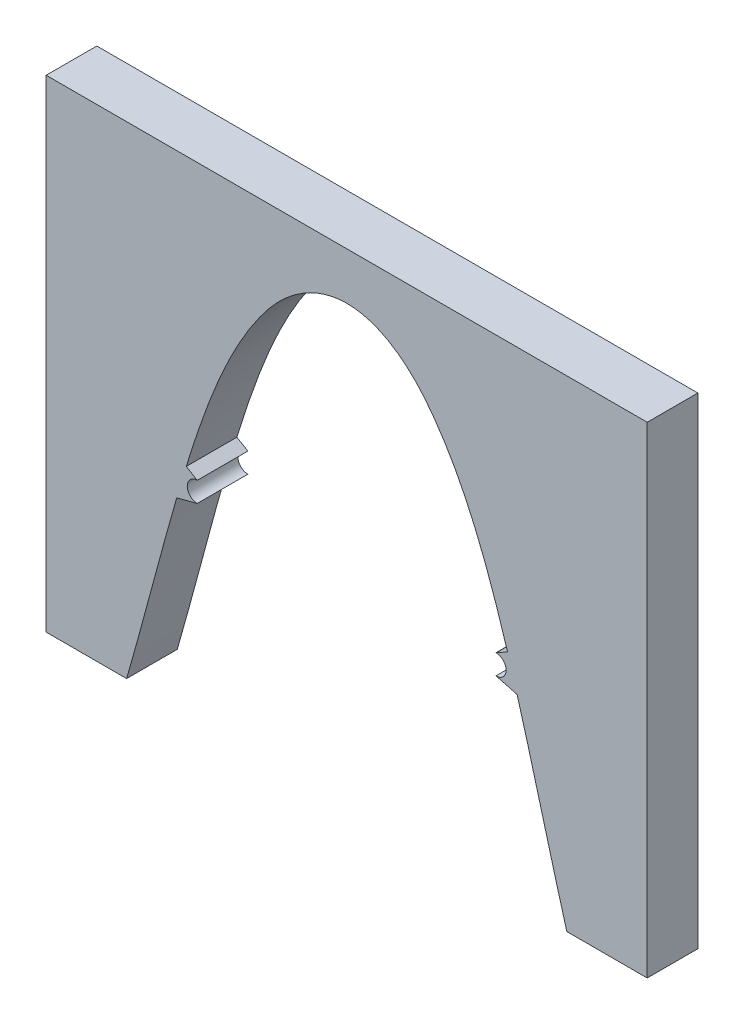
ISO-10303-21;
HEADER;
FILE_DESCRIPTION(('STEP AP214'),'2;1');
FILE_NAME('part.step','',(''),(''),'','','');
FILE_SCHEMA(('AUTOMOTIVE_DESIGN { 1 0 10303 214 1 1 1 1 }'));
ENDSEC;
DATA;
#1=APPLICATION_CONTEXT('core data for automotive mechanical design processes');
#2=APPLICATION_PROTOCOL_DEFINITION('international standard','automotive_design',2000,#1);
#3=PRODUCT_CONTEXT('',#1,'mechanical');
#4=PRODUCT('Part','Part','',(#3));
#5=PRODUCT_RELATED_PRODUCT_CATEGORY('part','',(#4));
#6=PRODUCT_DEFINITION_FORMATION('','',#4);
#7=PRODUCT_DEFINITION_CONTEXT('part definition',#1,'design');
#8=PRODUCT_DEFINITION('design','',#6,#7);
#9=PRODUCT_DEFINITION_SHAPE('','',#8);
#10=(LENGTH_UNIT() NAMED_UNIT(*) SI_UNIT(.MILLI.,.METRE.));
#11=(NAMED_UNIT(*) PLANE_ANGLE_UNIT() SI_UNIT($,.RADIAN.));
#12=(NAMED_UNIT(*) SI_UNIT($,.STERADIAN.) SOLID_ANGLE_UNIT());
#13=UNCERTAINTY_MEASURE_WITH_UNIT(LENGTH_MEASURE(1.E-05),#10,'distance_accuracy_value','');
#14=(GEOMETRIC_REPRESENTATION_CONTEXT(3) GLOBAL_UNCERTAINTY_ASSIGNED_CONTEXT((#13)) GLOBAL_UNIT_ASSIGNED_CONTEXT((#10,
#11,#12)) REPRESENTATION_CONTEXT('',''));
#15=CARTESIAN_POINT('',(0.,0.,0.));
#16=DIRECTION('',(0.,0.,1.));
#17=DIRECTION('',(1.,0.,0.));
#18=AXIS2_PLACEMENT_3D('',#15,#16,#17);
#19=CARTESIAN_POINT('',(124.901892582603,-12.896168333949,48.006));
#20=DIRECTION('',(0.,0.,-1.));
#21=DIRECTION('',(-1.,0.,0.));
#22=AXIS2_PLACEMENT_3D('',#19,#20,#21);
#23=CYLINDRICAL_SURFACE('',#22,9.49896947600651);
#24=CARTESIAN_POINT('',(124.901892582603,-12.896168333949,0.));
#25=DIRECTION('',(0.,0.,-1.));
#26=DIRECTION('',(1.,0.,0.));
#27=AXIS2_PLACEMENT_3D('',#24,#25,#26);
#28=CIRCLE('',#27,9.49896947600651);
#29=CARTESIAN_POINT('',(124.736169769664,-3.39864460113484,0.));
#30=VERTEX_POINT('',#29);
#31=CARTESIAN_POINT('',(124.736169769664,-22.3936920667635,0.));
#32=VERTEX_POINT('',#31);
#33=EDGE_CURVE('E367',#30,#32,#28,.T.);
#34=ORIENTED_EDGE('',*,*,#33,.T.);
#35=DIRECTION('',(0.,0.,-1.));
#36=VECTOR('',#35,1.);
#37=CARTESIAN_POINT('',(124.736169769664,-22.3936920667635,48.006));
#38=LINE('',#37,#36);
#39=CARTESIAN_POINT('',(124.736169769664,-22.3936920667635,48.006));
#40=VERTEX_POINT('',#39);
#41=EDGE_CURVE('E12',#40,#32,#38,.T.);
#42=ORIENTED_EDGE('',*,*,#41,.F.);
#43=CARTESIAN_POINT('',(124.901892582603,-12.896168333949,48.006));
#44=DIRECTION('',(0.,0.,-1.));
#45=DIRECTION('',(1.,0.,0.));
#46=AXIS2_PLACEMENT_3D('',#43,#44,#45);
#47=CIRCLE('',#46,9.49896947600651);
#48=CARTESIAN_POINT('',(124.736169769664,-3.39864460113484,48.006));
#49=VERTEX_POINT('',#48);
#50=EDGE_CURVE('E337',#49,#40,#47,.T.);
#51=ORIENTED_EDGE('',*,*,#50,.F.);
#52=DIRECTION('',(0.,0.,-1.));
#53=VECTOR('',#52,1.);
#54=CARTESIAN_POINT('',(124.736169769664,-3.39864460113484,48.006));
#55=LINE('',#54,#53);
#56=EDGE_CURVE('E190',#49,#30,#55,.T.);
#57=ORIENTED_EDGE('',*,*,#56,.T.);
#58=EDGE_LOOP('',(#34,#42,#51,#57));
#59=FACE_BOUND('',#58,.T.);
#60=ADVANCED_FACE('F40',(#59),#23,.F.);
#61=CARTESIAN_POINT('',(124.99306620108,-12.8961683339493,48.006));
#62=DIRECTION('',(0.,0.,-1.));
#63=DIRECTION('',(-1.,0.,0.));
#64=AXIS2_PLACEMENT_3D('',#61,#62,#63);
#65=CYLINDRICAL_SURFACE('',#64,9.50099746510036);
#66=CARTESIAN_POINT('',(124.99306620108,-12.8961683339493,0.));
#67=DIRECTION('',(0.,0.,1.));
#68=DIRECTION('',(-1.,0.,0.));
#69=AXIS2_PLACEMENT_3D('',#66,#67,#68);
#70=CIRCLE('',#69,9.50099746510036);
#71=CARTESIAN_POINT('',(124.993066201054,-22.3971657990497,0.));
#72=VERTEX_POINT('',#71);
#73=EDGE_CURVE('E364',#32,#72,#70,.T.);
#74=ORIENTED_EDGE('',*,*,#73,.T.);
#75=DIRECTION('',(0.,0.,-1.));
#76=VECTOR('',#75,1.);
#77=CARTESIAN_POINT('',(124.993066201054,-22.3971657990497,48.006));
#78=LINE('',#77,#76);
#79=CARTESIAN_POINT('',(124.993066201054,-22.3971657990497,48.006));
#80=VERTEX_POINT('',#79);
#81=EDGE_CURVE('E50',#80,#72,#78,.T.);
#82=ORIENTED_EDGE('',*,*,#81,.F.);
#83=CARTESIAN_POINT('',(124.99306620108,-12.8961683339493,48.006));
#84=DIRECTION('',(0.,0.,1.));
#85=DIRECTION('',(-1.,0.,0.));
#86=AXIS2_PLACEMENT_3D('',#83,#84,#85);
#87=CIRCLE('',#86,9.50099746510036);
#88=EDGE_CURVE('E126',#40,#80,#87,.T.);
#89=ORIENTED_EDGE('',*,*,#88,.F.);
#90=ORIENTED_EDGE('',*,*,#41,.T.);
#91=EDGE_LOOP('',(#74,#82,#89,#90));
#92=FACE_BOUND('',#91,.T.);
#93=ADVANCED_FACE('F556',(#92),#65,.T.);
#94=CARTESIAN_POINT('',(124.993066201054,-22.3971657990494,48.006));
#95=DIRECTION('',(0.257009893755215,0.966408771955187,0.));
#96=DIRECTION('',(-0.966408771955187,0.257009893755215,0.));
#97=AXIS2_PLACEMENT_3D('',#94,#95,#96);
#98=PLANE('',#97);
#99=DIRECTION('',(0.966408771955187,-0.257009893755215,0.));
#100=VECTOR('',#99,1.);
#101=CARTESIAN_POINT('',(124.993066201054,-22.3971657990494,0.));
#102=LINE('',#101,#100);
#103=CARTESIAN_POINT('',(144.806285869261,-27.6663579148995,0.));
#104=VERTEX_POINT('',#103);
#105=EDGE_CURVE('E362',#72,#104,#102,.T.);
#106=ORIENTED_EDGE('',*,*,#105,.T.);
#107=DIRECTION('',(0.,0.,-1.));
#108=VECTOR('',#107,1.);
#109=CARTESIAN_POINT('',(144.806285869261,-27.6663579148995,48.006));
#110=LINE('',#109,#108);
#111=CARTESIAN_POINT('',(144.806285869261,-27.6663579148995,48.006));
#112=VERTEX_POINT('',#111);
#113=EDGE_CURVE('E407',#112,#104,#110,.T.);
#114=ORIENTED_EDGE('',*,*,#113,.F.);
#115=DIRECTION('',(0.966408771955187,-0.257009893755215,0.));
#116=VECTOR('',#115,1.);
#117=CARTESIAN_POINT('',(124.993066201054,-22.3971657990494,48.006));
#118=LINE('',#117,#116);
#119=EDGE_CURVE('E519',#80,#112,#118,.T.);
#120=ORIENTED_EDGE('',*,*,#119,.F.);
#121=ORIENTED_EDGE('',*,*,#81,.T.);
#122=EDGE_LOOP('',(#106,#114,#120,#121));
#123=FACE_BOUND('',#122,.T.);
#124=ADVANCED_FACE('F535',(#123),#98,.F.);
#125=CARTESIAN_POINT('',(144.806285869261,-27.6663579148995,48.006));
#126=CARTESIAN_POINT('',(145.59650844187,-30.3948730622805,48.006));
#127=CARTESIAN_POINT('',(146.381833132504,-33.125288104705,48.006));
#128=CARTESIAN_POINT('',(162.628696684192,-89.9580414021384,48.006));
#129=CARTESIAN_POINT('',(176.395114075642,-144.717919567993,48.006));
#130=CARTESIAN_POINT('',(191.972620380307,-198.775273894856,48.006));
#131=B_SPLINE_CURVE_WITH_KNOTS('',3,(#125,#126,#127,#128,#129,#130),.UNSPECIFIED.,.F.,.F.,(4,2,
4),(-0.175685276259408,-0.163656923365318,0.0745283528940807),.UNSPECIFIED.);
#132=DIRECTION('',(0.,0.,-1.));
#133=VECTOR('',#132,1.);
#134=SURFACE_OF_LINEAR_EXTRUSION('',#131,#133);
#135=CARTESIAN_POINT('',(144.806285869261,-27.6663579148995,0.));
#136=CARTESIAN_POINT('',(145.59650844187,-30.3948730622805,0.));
#137=CARTESIAN_POINT('',(146.381833132504,-33.125288104705,0.));
#138=CARTESIAN_POINT('',(162.628696684192,-89.9580414021384,0.));
#139=CARTESIAN_POINT('',(176.395114075642,-144.717919567993,0.));
#140=CARTESIAN_POINT('',(191.972620380307,-198.775273894856,0.));
#141=B_SPLINE_CURVE_WITH_KNOTS('',3,(#135,#136,#137,#138,#139,#140),.UNSPECIFIED.,.F.,.F.,(4,2,
4),(-0.175685276259408,-0.163656923365318,0.0745283528940807),.UNSPECIFIED.);
#142=CARTESIAN_POINT('',(191.972620380307,-198.775273894856,0.));
#143=VERTEX_POINT('',#142);
#144=EDGE_CURVE('E360',#104,#143,#141,.T.);
#145=ORIENTED_EDGE('',*,*,#144,.T.);
#146=DIRECTION('',(0.,0.,-1.));
#147=VECTOR('',#146,1.);
#148=CARTESIAN_POINT('',(191.972620380307,-198.775273894856,48.006));
#149=LINE('',#148,#147);
#150=CARTESIAN_POINT('',(191.972620380307,-198.775273894856,48.006));
#151=VERTEX_POINT('',#150);
#152=EDGE_CURVE('E404',#151,#143,#149,.T.);
#153=ORIENTED_EDGE('',*,*,#152,.F.);
#154=CARTESIAN_POINT('',(191.972620380307,-198.775273894856,48.006));
#155=CARTESIAN_POINT('',(176.395114075642,-144.717919567993,48.006));
#156=CARTESIAN_POINT('',(162.628696684192,-89.9580414021384,48.006));
#157=CARTESIAN_POINT('',(146.381833132504,-33.125288104705,48.006));
#158=CARTESIAN_POINT('',(145.59650844187,-30.3948730622805,48.006));
#159=CARTESIAN_POINT('',(144.806285869261,-27.6663579148995,48.006));
#160=B_SPLINE_CURVE_WITH_KNOTS('',3,(#154,#155,#156,#157,#158,#159),.UNSPECIFIED.,.F.,.F.,(4,2,
4),(-0.175685276259408,0.0624999999999909,0.0745283528940807),.UNSPECIFIED.);
#161=EDGE_CURVE('E433',#112,#151,#160,.F.);
#162=ORIENTED_EDGE('',*,*,#161,.F.);
#163=ORIENTED_EDGE('',*,*,#113,.T.);
#164=EDGE_LOOP('',(#145,#153,#162,#163));
#165=FACE_BOUND('',#164,.T.);
#166=ADVANCED_FACE('F515',(#165),#134,.F.);
#167=CARTESIAN_POINT('',(268.172620380301,-198.775273894856,48.006));
#168=DIRECTION('',(0.,1.,0.));
#169=DIRECTION('',(-1.,0.,0.));
#170=AXIS2_PLACEMENT_3D('',#167,#168,#169);
#171=PLANE('',#170);
#172=DIRECTION('',(1.,0.,0.));
#173=VECTOR('',#172,1.);
#174=CARTESIAN_POINT('',(268.172620380301,-198.775273894856,0.));
#175=LINE('',#174,#173);
#176=CARTESIAN_POINT('',(268.172620380301,-198.775273894856,0.));
#177=VERTEX_POINT('',#176);
#178=EDGE_CURVE('E357',#143,#177,#175,.T.);
#179=ORIENTED_EDGE('',*,*,#178,.T.);
#180=DIRECTION('',(0.,0.,-1.));
#181=VECTOR('',#180,1.);
#182=CARTESIAN_POINT('',(268.172620380301,-198.775273894856,48.006));
#183=LINE('',#182,#181);
#184=CARTESIAN_POINT('',(268.172620380301,-198.775273894856,48.006));
#185=VERTEX_POINT('',#184);
#186=EDGE_CURVE('E400',#185,#177,#183,.T.);
#187=ORIENTED_EDGE('',*,*,#186,.F.);
#188=DIRECTION('',(1.,0.,0.));
#189=VECTOR('',#188,1.);
#190=CARTESIAN_POINT('',(268.172620380301,-198.775273894856,48.006));
#191=LINE('',#190,#189);
#192=EDGE_CURVE('E429',#151,#185,#191,.T.);
#193=ORIENTED_EDGE('',*,*,#192,.F.);
#194=ORIENTED_EDGE('',*,*,#152,.T.);
#195=EDGE_LOOP('',(#179,#187,#193,#194));
#196=FACE_BOUND('',#195,.T.);
#197=ADVANCED_FACE('F512',(#196),#171,.F.);
#198=CARTESIAN_POINT('',(268.172620380301,257.59348209541,48.006));
#199=DIRECTION('',(-1.,0.,0.));
#200=DIRECTION('',(0.,-1.,0.));
#201=AXIS2_PLACEMENT_3D('',#198,#199,#200);
#202=PLANE('',#201);
#203=DIRECTION('',(0.,1.,0.));
#204=VECTOR('',#203,1.);
#205=CARTESIAN_POINT('',(268.172620380301,257.59348209541,0.));
#206=LINE('',#205,#204);
#207=CARTESIAN_POINT('',(268.172620380301,257.59348209541,0.));
#208=VERTEX_POINT('',#207);
#209=EDGE_CURVE('E354',#177,#208,#206,.T.);
#210=ORIENTED_EDGE('',*,*,#209,.T.);
#211=DIRECTION('',(0.,0.,-1.));
#212=VECTOR('',#211,1.);
#213=CARTESIAN_POINT('',(268.172620380301,257.59348209541,48.006));
#214=LINE('',#213,#212);
#215=CARTESIAN_POINT('',(268.172620380301,257.59348209541,48.006));
#216=VERTEX_POINT('',#215);
#217=EDGE_CURVE('E396',#216,#208,#214,.T.);
#218=ORIENTED_EDGE('',*,*,#217,.F.);
#219=DIRECTION('',(0.,1.,0.));
#220=VECTOR('',#219,1.);
#221=CARTESIAN_POINT('',(268.172620380301,257.59348209541,48.006));
#222=LINE('',#221,#220);
#223=EDGE_CURVE('E432',#185,#216,#222,.T.);
#224=ORIENTED_EDGE('',*,*,#223,.F.);
#225=ORIENTED_EDGE('',*,*,#186,.T.);
#226=EDGE_LOOP('',(#210,#218,#224,#225));
#227=FACE_BOUND('',#226,.T.);
#228=ADVANCED_FACE('F507',(#227),#202,.F.);
#229=CARTESIAN_POINT('',(-301.738433253099,257.59348209541,48.006));
#230=DIRECTION('',(0.,-1.,0.));
#231=DIRECTION('',(0.,0.,-1.));
#232=AXIS2_PLACEMENT_3D('',#229,#230,#231);
#233=PLANE('',#232);
#234=DIRECTION('',(-1.,0.,0.));
#235=VECTOR('',#234,1.);
#236=CARTESIAN_POINT('',(-301.738433253099,257.59348209541,0.));
#237=LINE('',#236,#235);
#238=CARTESIAN_POINT('',(-301.738433253099,257.59348209541,0.));
#239=VERTEX_POINT('',#238);
#240=EDGE_CURVE('E351',#208,#239,#237,.T.);
#241=ORIENTED_EDGE('',*,*,#240,.T.);
#242=DIRECTION('',(0.,0.,-1.));
#243=VECTOR('',#242,1.);
#244=CARTESIAN_POINT('',(-301.738433253099,257.59348209541,48.006));
#245=LINE('',#244,#243);
#246=CARTESIAN_POINT('',(-301.738433253099,257.59348209541,48.006));
#247=VERTEX_POINT('',#246);
#248=EDGE_CURVE('E391',#247,#239,#245,.T.);
#249=ORIENTED_EDGE('',*,*,#248,.F.);
#250=DIRECTION('',(-1.,0.,0.));
#251=VECTOR('',#250,1.);
#252=CARTESIAN_POINT('',(-301.738433253099,257.59348209541,48.006));
#253=LINE('',#252,#251);
#254=EDGE_CURVE('E447',#216,#247,#253,.T.);
#255=ORIENTED_EDGE('',*,*,#254,.F.);
#256=ORIENTED_EDGE('',*,*,#217,.T.);
#257=EDGE_LOOP('',(#241,#249,#255,#256));
#258=FACE_BOUND('',#257,.T.);
#259=ADVANCED_FACE('F503',(#258),#233,.F.);
#260=CARTESIAN_POINT('',(-301.738433253099,-199.728491805494,48.006));
#261=DIRECTION('',(1.,0.,0.));
#262=DIRECTION('',(0.,0.,-1.));
#263=AXIS2_PLACEMENT_3D('',#260,#261,#262);
#264=PLANE('',#263);
#265=DIRECTION('',(0.,-1.,0.));
#266=VECTOR('',#265,1.);
#267=CARTESIAN_POINT('',(-301.738433253099,-199.728491805494,0.));
#268=LINE('',#267,#266);
#269=CARTESIAN_POINT('',(-301.738433253099,-199.728491805494,0.));
#270=VERTEX_POINT('',#269);
#271=EDGE_CURVE('E348',#239,#270,#268,.T.);
#272=ORIENTED_EDGE('',*,*,#271,.T.);
#273=DIRECTION('',(0.,0.,-1.));
#274=VECTOR('',#273,1.);
#275=CARTESIAN_POINT('',(-301.738433253099,-199.728491805494,48.006));
#276=LINE('',#275,#274);
#277=CARTESIAN_POINT('',(-301.738433253099,-199.728491805494,48.006));
#278=VERTEX_POINT('',#277);
#279=EDGE_CURVE('E387',#278,#270,#276,.T.);
#280=ORIENTED_EDGE('',*,*,#279,.F.);
#281=DIRECTION('',(0.,-1.,0.));
#282=VECTOR('',#281,1.);
#283=CARTESIAN_POINT('',(-301.738433253099,-199.728491805494,48.006));
#284=LINE('',#283,#282);
#285=EDGE_CURVE('E280',#247,#278,#284,.T.);
#286=ORIENTED_EDGE('',*,*,#285,.F.);
#287=ORIENTED_EDGE('',*,*,#248,.T.);
#288=EDGE_LOOP('',(#272,#280,#286,#287));
#289=FACE_BOUND('',#288,.T.);
#290=ADVANCED_FACE('F501',(#289),#264,.F.);
#291=CARTESIAN_POINT('',(-225.447809165273,-199.728491805494,48.006));
#292=DIRECTION('',(0.,1.,0.));
#293=DIRECTION('',(0.,0.,1.));
#294=AXIS2_PLACEMENT_3D('',#291,#292,#293);
#295=PLANE('',#294);
#296=DIRECTION('',(1.,0.,0.));
#297=VECTOR('',#296,1.);
#298=CARTESIAN_POINT('',(-225.447809165273,-199.728491805494,0.));
#299=LINE('',#298,#297);
#300=CARTESIAN_POINT('',(-225.447809165273,-199.728491805494,0.));
#301=VERTEX_POINT('',#300);
#302=EDGE_CURVE('E346',#270,#301,#299,.T.);
#303=ORIENTED_EDGE('',*,*,#302,.T.);
#304=DIRECTION('',(0.,0.,-1.));
#305=VECTOR('',#304,1.);
#306=CARTESIAN_POINT('',(-225.447809165273,-199.728491805494,48.006));
#307=LINE('',#306,#305);
#308=CARTESIAN_POINT('',(-225.447809165273,-199.728491805494,48.006));
#309=VERTEX_POINT('',#308);
#310=EDGE_CURVE('E392',#309,#301,#307,.T.);
#311=ORIENTED_EDGE('',*,*,#310,.F.);
#312=DIRECTION('',(1.,0.,0.));
#313=VECTOR('',#312,1.);
#314=CARTESIAN_POINT('',(-225.447809165273,-199.728491805494,48.006));
#315=LINE('',#314,#313);
#316=EDGE_CURVE('E457',#278,#309,#315,.T.);
#317=ORIENTED_EDGE('',*,*,#316,.F.);
#318=ORIENTED_EDGE('',*,*,#279,.T.);
#319=EDGE_LOOP('',(#303,#311,#317,#318));
#320=FACE_BOUND('',#319,.T.);
#321=ADVANCED_FACE('F272',(#320),#295,.F.);
#322=CARTESIAN_POINT('',(-225.447809165273,-199.728491805495,48.006));
#323=CARTESIAN_POINT('',(-209.643570838735,-145.052272813834,48.006));
#324=CARTESIAN_POINT('',(-195.78315438571,-89.8031516136939,48.006));
#325=CARTESIAN_POINT('',(-179.405906532363,-32.5824678490614,48.006));
#326=CARTESIAN_POINT('',(-178.68600314117,-30.0812970735596,48.006));
#327=CARTESIAN_POINT('',(-177.961890902173,-27.5813667708782,48.006));
#328=B_SPLINE_CURVE_WITH_KNOTS('',3,(#322,#323,#324,#325,#326,#327),.UNSPECIFIED.,.F.,.F.,(4,2,
4),(0.926684910727146,1.16318414203193,1.17399923130478),.UNSPECIFIED.);
#329=DIRECTION('',(0.,0.,-1.));
#330=VECTOR('',#329,1.);
#331=SURFACE_OF_LINEAR_EXTRUSION('',#328,#330);
#332=CARTESIAN_POINT('',(-225.447809165273,-199.728491805495,0.));
#333=CARTESIAN_POINT('',(-209.643570838735,-145.052272813834,0.));
#334=CARTESIAN_POINT('',(-195.78315438571,-89.8031516136939,0.));
#335=CARTESIAN_POINT('',(-179.405906532363,-32.5824678490614,0.));
#336=CARTESIAN_POINT('',(-178.68600314117,-30.0812970735596,0.));
#337=CARTESIAN_POINT('',(-177.961890902173,-27.5813667708782,0.));
#338=B_SPLINE_CURVE_WITH_KNOTS('',3,(#332,#333,#334,#335,#336,#337),.UNSPECIFIED.,.F.,.F.,(4,2,
4),(0.926684910727146,1.16318414203193,1.17399923130478),.UNSPECIFIED.);
#339=CARTESIAN_POINT('',(-177.961890902173,-27.5813667708782,0.));
#340=VERTEX_POINT('',#339);
#341=EDGE_CURVE('E253',#301,#340,#338,.T.);
#342=ORIENTED_EDGE('',*,*,#341,.T.);
#343=DIRECTION('',(0.,0.,-1.));
#344=VECTOR('',#343,1.);
#345=CARTESIAN_POINT('',(-177.961890902173,-27.5813667708782,48.006));
#346=LINE('',#345,#344);
#347=CARTESIAN_POINT('',(-177.961890902173,-27.5813667708782,48.006));
#348=VERTEX_POINT('',#347);
#349=EDGE_CURVE('E386',#348,#340,#346,.T.);
#350=ORIENTED_EDGE('',*,*,#349,.F.);
#351=CARTESIAN_POINT('',(-177.961890902173,-27.5813667708782,48.006));
#352=CARTESIAN_POINT('',(-178.68600314117,-30.0812970735596,48.006));
#353=CARTESIAN_POINT('',(-179.405906532363,-32.5824678490614,48.006));
#354=CARTESIAN_POINT('',(-195.78315438571,-89.8031516136939,48.006));
#355=CARTESIAN_POINT('',(-209.643570838735,-145.052272813834,48.006));
#356=CARTESIAN_POINT('',(-225.447809165273,-199.728491805495,48.006));
#357=B_SPLINE_CURVE_WITH_KNOTS('',3,(#351,#352,#353,#354,#355,#356),.UNSPECIFIED.,.F.,.F.,(4,2,
4),(0.926684910727146,0.937499999999989,1.17399923130478),.UNSPECIFIED.);
#358=EDGE_CURVE('E461',#309,#348,#357,.F.);
#359=ORIENTED_EDGE('',*,*,#358,.F.);
#360=ORIENTED_EDGE('',*,*,#310,.T.);
#361=EDGE_LOOP('',(#342,#350,#359,#360));
#362=FACE_BOUND('',#361,.T.);
#363=ADVANCED_FACE('F260',(#362),#331,.F.);
#364=CARTESIAN_POINT('',(-158.46825498602,-22.3971657990494,48.006));
#365=DIRECTION('',(-0.25700989370926,0.966408771967409,0.));
#366=DIRECTION('',(-0.966408771967409,-0.25700989370926,0.));
#367=AXIS2_PLACEMENT_3D('',#364,#365,#366);
#368=PLANE('',#367);
#369=DIRECTION('',(0.966408771967409,0.25700989370926,0.));
#370=VECTOR('',#369,1.);
#371=CARTESIAN_POINT('',(-158.46825498602,-22.3971657990494,0.));
#372=LINE('',#371,#370);
#373=CARTESIAN_POINT('',(-158.46825498602,-22.3971657990494,0.));
#374=VERTEX_POINT('',#373);
#375=EDGE_CURVE('E341',#340,#374,#372,.T.);
#376=ORIENTED_EDGE('',*,*,#375,.T.);
#377=DIRECTION('',(0.,0.,-1.));
#378=VECTOR('',#377,1.);
#379=CARTESIAN_POINT('',(-158.46825498602,-22.3971657990494,48.006));
#380=LINE('',#379,#378);
#381=CARTESIAN_POINT('',(-158.46825498602,-22.3971657990494,48.006));
#382=VERTEX_POINT('',#381);
#383=EDGE_CURVE('E382',#382,#374,#380,.T.);
#384=ORIENTED_EDGE('',*,*,#383,.F.);
#385=DIRECTION('',(0.966408771967409,0.25700989370926,0.));
#386=VECTOR('',#385,1.);
#387=CARTESIAN_POINT('',(-158.46825498602,-22.3971657990494,48.006));
#388=LINE('',#387,#386);
#389=EDGE_CURVE('E245',#348,#382,#388,.T.);
#390=ORIENTED_EDGE('',*,*,#389,.F.);
#391=ORIENTED_EDGE('',*,*,#349,.T.);
#392=EDGE_LOOP('',(#376,#384,#390,#391));
#393=FACE_BOUND('',#392,.T.);
#394=ADVANCED_FACE('F271',(#393),#368,.F.);
#395=CARTESIAN_POINT('',(-158.46825498602,-12.896168333949,48.006));
#396=DIRECTION('',(0.,0.,-1.));
#397=DIRECTION('',(-1.,0.,0.));
#398=AXIS2_PLACEMENT_3D('',#395,#396,#397);
#399=CYLINDRICAL_SURFACE('',#398,9.50099746510036);
#400=CARTESIAN_POINT('',(-158.46825498602,-12.896168333949,0.));
#401=DIRECTION('',(0.,0.,-1.));
#402=DIRECTION('',(1.,0.,0.));
#403=AXIS2_PLACEMENT_3D('',#400,#401,#402);
#404=CIRCLE('',#403,9.50099746510036);
#405=CARTESIAN_POINT('',(-158.46825498602,-3.39517086884866,0.));
#406=VERTEX_POINT('',#405);
#407=EDGE_CURVE('E330',#374,#406,#404,.T.);
#408=ORIENTED_EDGE('',*,*,#407,.T.);
#409=DIRECTION('',(0.,0.,-1.));
#410=VECTOR('',#409,1.);
#411=CARTESIAN_POINT('',(-158.46825498602,-3.39517086884866,48.006));
#412=LINE('',#411,#410);
#413=CARTESIAN_POINT('',(-158.46825498602,-3.39517086884866,48.006));
#414=VERTEX_POINT('',#413);
#415=EDGE_CURVE('E378',#414,#406,#412,.T.);
#416=ORIENTED_EDGE('',*,*,#415,.F.);
#417=CARTESIAN_POINT('',(-158.46825498602,-12.896168333949,48.006));
#418=DIRECTION('',(0.,0.,-1.));
#419=DIRECTION('',(1.,0.,0.));
#420=AXIS2_PLACEMENT_3D('',#417,#418,#419);
#421=CIRCLE('',#420,9.50099746510036);
#422=EDGE_CURVE('E283',#382,#414,#421,.T.);
#423=ORIENTED_EDGE('',*,*,#422,.F.);
#424=ORIENTED_EDGE('',*,*,#383,.T.);
#425=EDGE_LOOP('',(#408,#416,#423,#424));
#426=FACE_BOUND('',#425,.T.);
#427=ADVANCED_FACE('F485',(#426),#399,.F.);
#428=CARTESIAN_POINT('',(-158.46825498602,-3.39517086884866,48.006));
#429=DIRECTION('',(-0.506676083440227,-0.862136501065622,0.));
#430=DIRECTION('',(0.862136501065622,-0.506676083440227,0.));
#431=AXIS2_PLACEMENT_3D('',#428,#429,#430);
#432=PLANE('',#431);
#433=DIRECTION('',(-0.862136501065622,0.506676083440227,0.));
#434=VECTOR('',#433,1.);
#435=CARTESIAN_POINT('',(-158.46825498602,-3.39517086884866,0.));
#436=LINE('',#435,#434);
#437=CARTESIAN_POINT('',(-168.917377957394,2.74576005795613,0.));
#438=VERTEX_POINT('',#437);
#439=EDGE_CURVE('E322',#406,#438,#436,.T.);
#440=ORIENTED_EDGE('',*,*,#439,.T.);
#441=DIRECTION('',(0.,0.,-1.));
#442=VECTOR('',#441,1.);
#443=CARTESIAN_POINT('',(-168.917377957394,2.74576005795613,48.006));
#444=LINE('',#443,#442);
#445=CARTESIAN_POINT('',(-168.917377957394,2.74576005795613,48.006));
#446=VERTEX_POINT('',#445);
#447=EDGE_CURVE('E183',#446,#438,#444,.T.);
#448=ORIENTED_EDGE('',*,*,#447,.F.);
#449=DIRECTION('',(-0.862136501065622,0.506676083440227,0.));
#450=VECTOR('',#449,1.);
#451=CARTESIAN_POINT('',(-158.46825498602,-3.39517086884866,48.006));
#452=LINE('',#451,#450);
#453=EDGE_CURVE('E170',#414,#446,#452,.T.);
#454=ORIENTED_EDGE('',*,*,#453,.F.);
#455=ORIENTED_EDGE('',*,*,#415,.T.);
#456=EDGE_LOOP('',(#440,#448,#454,#455));
#457=FACE_BOUND('',#456,.T.);
#458=ADVANCED_FACE('F303',(#457),#432,.F.);
#459=CARTESIAN_POINT('',(-168.917377957394,2.74576005795568,48.006));
#460=CARTESIAN_POINT('',(-168.361264211709,4.5512403467316,48.006));
#461=CARTESIAN_POINT('',(-167.801898158451,6.35576208358701,48.006));
#462=CARTESIAN_POINT('',(-164.998557992569,15.3390858368208,48.006));
#463=CARTESIAN_POINT('',(-162.702412423869,22.5025113710151,48.006));
#464=CARTESIAN_POINT('',(-159.151256342876,33.2161319384308,48.006));
#465=CARTESIAN_POINT('',(-157.949711033941,36.782317952885,48.006));
#466=CARTESIAN_POINT('',(-155.507905267561,43.8943626566095,48.006));
#467=CARTESIAN_POINT('',(-154.267293069628,47.4411116129425,48.006));
#468=CARTESIAN_POINT('',(-147.950288070501,65.1212447961491,48.006));
#469=CARTESIAN_POINT('',(-142.536695846763,79.0959739069872,48.006));
#470=CARTESIAN_POINT('',(-133.554665543627,99.6526579040755,48.006));
#471=CARTESIAN_POINT('',(-130.416658057338,106.437133942879,48.006));
#472=CARTESIAN_POINT('',(-123.784949756423,119.838729368881,48.006));
#473=CARTESIAN_POINT('',(-120.291186221425,126.455819245628,48.006));
#474=CARTESIAN_POINT('',(-112.869324350876,139.485640884685,48.006));
#475=CARTESIAN_POINT('',(-108.941626474103,145.898561066163,48.006));
#476=CARTESIAN_POINT('',(-103.700307998918,153.758645521984,48.006));
#477=CARTESIAN_POINT('',(-102.635373146219,155.322818495641,48.006));
#478=CARTESIAN_POINT('',(-100.470213050667,158.434560022636,48.006));
#479=CARTESIAN_POINT('',(-99.369002362514,159.983437205039,48.006));
#480=CARTESIAN_POINT('',(-97.1383355867754,163.051227009903,48.006));
#481=CARTESIAN_POINT('',(-96.0080920776105,164.571319881094,48.006));
#482=CARTESIAN_POINT('',(-93.7162729962895,167.582502096022,48.006));
#483=CARTESIAN_POINT('',(-92.5563312512487,169.07510384415,48.006));
#484=CARTESIAN_POINT('',(-89.0010755068467,173.483084422119,48.006));
#485=CARTESIAN_POINT('',(-86.5307025327444,176.328982508388,48.006));
#486=CARTESIAN_POINT('',(-81.3807761290117,181.827144093703,48.006));
#487=CARTESIAN_POINT('',(-77.3599982344726,185.804199186038,48.006));
#488=CARTESIAN_POINT('',(-73.0718822433882,189.533784208378,48.006));
#489=CARTESIAN_POINT('',(-70.8796894921333,191.354019241508,48.006));
#490=CARTESIAN_POINT('',(-70.1409249315532,191.95332765319,48.006));
#491=CARTESIAN_POINT('',(-68.6467130557853,193.136501550521,48.006));
#492=CARTESIAN_POINT('',(-67.890435469224,193.720972815361,48.006));
#493=CARTESIAN_POINT('',(-64.0835623141189,196.589201118535,48.006));
#494=CARTESIAN_POINT('',(-60.947143119936,198.719630219717,48.006));
#495=CARTESIAN_POINT('',(-54.4713818223912,202.614119431097,48.006));
#496=CARTESIAN_POINT('',(-51.1319770334717,204.378066365087,48.006));
#497=CARTESIAN_POINT('',(-45.9452732638326,206.703343412529,48.006));
#498=CARTESIAN_POINT('',(-44.1868841137063,207.425196579068,48.006));
#499=CARTESIAN_POINT('',(-41.500300424506,208.419508903263,48.006));
#500=CARTESIAN_POINT('',(-40.5947908710573,208.736732776797,48.006));
#501=CARTESIAN_POINT('',(-38.7791083143001,209.336382439281,48.006));
#502=CARTESIAN_POINT('',(-37.8683640239557,209.619128705565,48.006));
#503=CARTESIAN_POINT('',(-33.2999115900916,210.946196930403,48.006));
#504=CARTESIAN_POINT('',(-29.5978066433578,211.729330269502,48.006));
#505=CARTESIAN_POINT('',(-23.9698323818542,212.463879048713,48.006));
#506=CARTESIAN_POINT('',(-22.0812959096182,212.634925473396,48.006));
#507=CARTESIAN_POINT('',(-19.2292831763234,212.77849333656,48.006));
#508=CARTESIAN_POINT('',(-18.2754086267722,212.807502125289,48.006));
#509=CARTESIAN_POINT('',(-16.3611290640222,212.827100657663,48.006));
#510=CARTESIAN_POINT('',(-15.4007092457968,212.817467767256,48.006));
#511=CARTESIAN_POINT('',(-6.80726537961385,212.559011489963,48.006));
#512=CARTESIAN_POINT('',(0.616700414971527,211.111006780172,48.006));
#513=CARTESIAN_POINT('',(9.65808309519001,207.94695519346,48.006));
#514=CARTESIAN_POINT('',(11.4352659489401,207.252597560284,48.006));
#515=CARTESIAN_POINT('',(14.9276234211528,205.755045006506,48.006));
#516=CARTESIAN_POINT('',(16.6437684935956,204.95133434854,48.006));
#517=CARTESIAN_POINT('',(21.7088059547619,202.387660075126,48.006));
#518=CARTESIAN_POINT('',(24.9751956106676,200.476791241609,48.006));
#519=CARTESIAN_POINT('',(29.7300977601063,197.345850463817,48.006));
#520=CARTESIAN_POINT('',(31.2908481069651,196.257908312536,48.006));
#521=CARTESIAN_POINT('',(33.5975942931985,194.563112066772,48.006));
#522=CARTESIAN_POINT('',(34.361043989878,193.987395747114,48.006));
#523=CARTESIAN_POINT('',(35.8691973631891,192.821403705961,48.006));
#524=CARTESIAN_POINT('',(36.6148928785324,192.230444978155,48.006));
#525=CARTESIAN_POINT('',(40.3031916145817,189.237478590586,48.006));
#526=CARTESIAN_POINT('',(43.125667166948,186.721341125165,48.006));
#527=CARTESIAN_POINT('',(48.5476540757157,181.477234393164,48.006));
#528=CARTESIAN_POINT('',(51.1469471279355,178.749057722125,48.006));
#529=CARTESIAN_POINT('',(54.8948638631301,174.513310302443,48.006));
#530=CARTESIAN_POINT('',(56.1187414605091,173.077236110291,48.006));
#531=CARTESIAN_POINT('',(58.5165826616587,170.157665891626,48.006));
#532=CARTESIAN_POINT('',(59.6886426484573,168.672361293967,48.006));
#533=CARTESIAN_POINT('',(61.9997154379968,165.670354929736,48.006));
#534=CARTESIAN_POINT('',(63.1394662551579,164.15435432921,48.006));
#535=CARTESIAN_POINT('',(65.3890462614679,161.093925459189,48.006));
#536=CARTESIAN_POINT('',(66.4982707773549,159.550177506515,48.006));
#537=CARTESIAN_POINT('',(69.765373981532,154.903644709419,48.006));
#538=CARTESIAN_POINT('',(71.8690188740152,151.777087042552,48.006));
#539=CARTESIAN_POINT('',(77.9818921125695,142.320585741905,48.006));
#540=CARTESIAN_POINT('',(81.7938021858022,135.914102083203,48.006));
#541=CARTESIAN_POINT('',(88.9919843332871,122.936029210281,48.006));
#542=CARTESIAN_POINT('',(92.3776003299901,116.364185502694,48.006));
#543=CARTESIAN_POINT('',(98.8035082991394,103.086546431429,48.006));
#544=CARTESIAN_POINT('',(101.843868220156,96.3807774250931,48.006));
#545=CARTESIAN_POINT('',(110.54807703857,76.10176560281,48.006));
#546=CARTESIAN_POINT('',(115.79744619363,62.3677455341896,48.006));
#547=CARTESIAN_POINT('',(123.15749962739,41.5673340201126,48.006));
#548=CARTESIAN_POINT('',(125.524522044937,34.6003764854341,48.006));
#549=CARTESIAN_POINT('',(130.130676763684,20.6168526669646,48.006));
#550=CARTESIAN_POINT('',(132.368798726987,13.5998944717364,48.006));
#551=CARTESIAN_POINT('',(134.93608050438,5.34018619742493,48.006));
#552=CARTESIAN_POINT('',(135.31469699176,4.11662042880501,48.006));
#553=CARTESIAN_POINT('',(135.691858464838,2.89249025816929,48.006));
#554=B_SPLINE_CURVE_WITH_KNOTS('',3,(#459,#460,#461,#462,#463,#464,#465,#466,#467,#468,#469,
#470,#471,#472,#473,#474,#475,#476,#477,#478,#479,#480,#481,#482,#483,#484,#485,#486,#487,#488,
#489,#490,#491,#492,#493,#494,#495,#496,#497,#498,#499,#500,#501,#502,#503,#504,#505,#506,#507,
#508,#509,#510,#511,#512,#513,#514,#515,#516,#517,#518,#519,#520,#521,#522,#523,#524,#525,#526,
#527,#528,#529,#530,#531,#532,#533,#534,#535,#536,#537,#538,#539,#540,#541,#542,#543,#544,#545,
#546,#547,#548,#549,#550,#551,#552,#553),.UNSPECIFIED.,.F.,.F.,(4,2,2,2,2,2,2,2,2,2,2,2,2,2,1,2,
2,2,2,2,2,2,2,2,2,2,2,2,2,2,2,2,2,2,2,2,2,2,2,2,2,2,2,2,2,2,2,4),(0.11956876489132,
0.127418499295101,0.158668499295107,0.17429349929511,0.189918499295112,0.252418499295123,
0.283668499295128,0.314918499295133,0.346168499295139,0.35398099929514,0.361793499295141,
0.369605999295142,0.377418499295143,0.393043499295145,0.408668499295147,0.416480999295149,
0.420387249295149,0.424293499295149,0.439918499295147,0.455543499295145,0.463355999295143,
0.467262249295142,0.471168499295141,0.48679349929514,0.494605999295139,0.498512249295138,
0.502418499295138,0.533668499295135,0.541480999295134,0.549293499295133,0.56491849929513,
0.572730999295129,0.576637249295129,0.580543499295128,0.596168499295128,0.611793499295127,
0.619605999295127,0.627418499295127,0.635230999295126,0.643043499295126,0.658668499295124,
0.68991849929512,0.721168499295117,0.752418499295114,0.814918499295106,0.846168499295102,
0.877418499295098,0.88284973440376),.UNSPECIFIED.);
#555=DIRECTION('',(0.,0.,-1.));
#556=VECTOR('',#555,1.);
#557=SURFACE_OF_LINEAR_EXTRUSION('',#554,#556);
#558=CARTESIAN_POINT('',(-168.917377957394,2.74576005795568,0.));
#559=CARTESIAN_POINT('',(-168.361264211709,4.5512403467316,0.));
#560=CARTESIAN_POINT('',(-167.801898158451,6.35576208358701,0.));
#561=CARTESIAN_POINT('',(-164.998557992569,15.3390858368208,0.));
#562=CARTESIAN_POINT('',(-162.702412423869,22.5025113710151,0.));
#563=CARTESIAN_POINT('',(-159.151256342876,33.2161319384308,0.));
#564=CARTESIAN_POINT('',(-157.949711033941,36.782317952885,0.));
#565=CARTESIAN_POINT('',(-155.507905267561,43.8943626566095,0.));
#566=CARTESIAN_POINT('',(-154.267293069628,47.4411116129425,0.));
#567=CARTESIAN_POINT('',(-147.950288070501,65.1212447961491,0.));
#568=CARTESIAN_POINT('',(-142.536695846763,79.0959739069872,0.));
#569=CARTESIAN_POINT('',(-133.554665543627,99.6526579040755,0.));
#570=CARTESIAN_POINT('',(-130.416658057338,106.437133942879,0.));
#571=CARTESIAN_POINT('',(-123.784949756423,119.838729368881,0.));
#572=CARTESIAN_POINT('',(-120.291186221425,126.455819245628,0.));
#573=CARTESIAN_POINT('',(-112.869324350876,139.485640884685,0.));
#574=CARTESIAN_POINT('',(-108.941626474103,145.898561066163,0.));
#575=CARTESIAN_POINT('',(-103.700307998918,153.758645521984,0.));
#576=CARTESIAN_POINT('',(-102.635373146219,155.322818495641,0.));
#577=CARTESIAN_POINT('',(-100.470213050667,158.434560022636,0.));
#578=CARTESIAN_POINT('',(-99.369002362514,159.983437205039,0.));
#579=CARTESIAN_POINT('',(-97.1383355867754,163.051227009903,0.));
#580=CARTESIAN_POINT('',(-96.0080920776105,164.571319881094,0.));
#581=CARTESIAN_POINT('',(-93.7162729962895,167.582502096022,0.));
#582=CARTESIAN_POINT('',(-92.5563312512487,169.07510384415,0.));
#583=CARTESIAN_POINT('',(-89.0010755068467,173.483084422119,0.));
#584=CARTESIAN_POINT('',(-86.5307025327444,176.328982508388,0.));
#585=CARTESIAN_POINT('',(-81.3807761290117,181.827144093703,0.));
#586=CARTESIAN_POINT('',(-77.3599982344726,185.804199186038,0.));
#587=CARTESIAN_POINT('',(-73.0718822433882,189.533784208378,0.));
#588=CARTESIAN_POINT('',(-70.8796894921333,191.354019241508,0.));
#589=CARTESIAN_POINT('',(-70.1409249315532,191.95332765319,0.));
#590=CARTESIAN_POINT('',(-68.6467130557853,193.136501550521,0.));
#591=CARTESIAN_POINT('',(-67.890435469224,193.720972815361,0.));
#592=CARTESIAN_POINT('',(-64.0835623141189,196.589201118535,0.));
#593=CARTESIAN_POINT('',(-60.947143119936,198.719630219717,0.));
#594=CARTESIAN_POINT('',(-54.4713818223912,202.614119431097,0.));
#595=CARTESIAN_POINT('',(-51.1319770334717,204.378066365087,0.));
#596=CARTESIAN_POINT('',(-45.9452732638326,206.703343412529,0.));
#597=CARTESIAN_POINT('',(-44.1868841137063,207.425196579068,0.));
#598=CARTESIAN_POINT('',(-41.500300424506,208.419508903263,0.));
#599=CARTESIAN_POINT('',(-40.5947908710573,208.736732776797,0.));
#600=CARTESIAN_POINT('',(-38.7791083143001,209.336382439281,0.));
#601=CARTESIAN_POINT('',(-37.8683640239557,209.619128705565,0.));
#602=CARTESIAN_POINT('',(-33.2999115900916,210.946196930403,0.));
#603=CARTESIAN_POINT('',(-29.5978066433578,211.729330269502,0.));
#604=CARTESIAN_POINT('',(-23.9698323818542,212.463879048713,0.));
#605=CARTESIAN_POINT('',(-22.0812959096182,212.634925473396,0.));
#606=CARTESIAN_POINT('',(-19.2292831763234,212.77849333656,0.));
#607=CARTESIAN_POINT('',(-18.2754086267722,212.807502125289,0.));
#608=CARTESIAN_POINT('',(-16.3611290640222,212.827100657663,0.));
#609=CARTESIAN_POINT('',(-15.4007092457968,212.817467767256,0.));
#610=CARTESIAN_POINT('',(-6.80726537961385,212.559011489963,0.));
#611=CARTESIAN_POINT('',(0.616700414971527,211.111006780172,0.));
#612=CARTESIAN_POINT('',(9.65808309519001,207.94695519346,0.));
#613=CARTESIAN_POINT('',(11.4352659489401,207.252597560284,0.));
#614=CARTESIAN_POINT('',(14.9276234211528,205.755045006506,0.));
#615=CARTESIAN_POINT('',(16.6437684935956,204.95133434854,0.));
#616=CARTESIAN_POINT('',(21.7088059547619,202.387660075126,0.));
#617=CARTESIAN_POINT('',(24.9751956106676,200.476791241609,0.));
#618=CARTESIAN_POINT('',(29.7300977601063,197.345850463817,0.));
#619=CARTESIAN_POINT('',(31.2908481069651,196.257908312536,0.));
#620=CARTESIAN_POINT('',(33.5975942931985,194.563112066772,0.));
#621=CARTESIAN_POINT('',(34.361043989878,193.987395747114,0.));
#622=CARTESIAN_POINT('',(35.8691973631891,192.821403705961,0.));
#623=CARTESIAN_POINT('',(36.6148928785324,192.230444978155,0.));
#624=CARTESIAN_POINT('',(40.3031916145817,189.237478590586,0.));
#625=CARTESIAN_POINT('',(43.125667166948,186.721341125165,0.));
#626=CARTESIAN_POINT('',(48.5476540757157,181.477234393164,0.));
#627=CARTESIAN_POINT('',(51.1469471279355,178.749057722125,0.));
#628=CARTESIAN_POINT('',(54.8948638631301,174.513310302443,0.));
#629=CARTESIAN_POINT('',(56.1187414605091,173.077236110291,0.));
#630=CARTESIAN_POINT('',(58.5165826616587,170.157665891626,0.));
#631=CARTESIAN_POINT('',(59.6886426484573,168.672361293967,0.));
#632=CARTESIAN_POINT('',(61.9997154379968,165.670354929736,0.));
#633=CARTESIAN_POINT('',(63.1394662551579,164.15435432921,0.));
#634=CARTESIAN_POINT('',(65.3890462614679,161.093925459189,0.));
#635=CARTESIAN_POINT('',(66.4982707773549,159.550177506515,0.));
#636=CARTESIAN_POINT('',(69.765373981532,154.903644709419,0.));
#637=CARTESIAN_POINT('',(71.8690188740152,151.777087042552,0.));
#638=CARTESIAN_POINT('',(77.9818921125695,142.320585741905,0.));
#639=CARTESIAN_POINT('',(81.7938021858022,135.914102083203,0.));
#640=CARTESIAN_POINT('',(88.9919843332871,122.936029210281,0.));
#641=CARTESIAN_POINT('',(92.3776003299901,116.364185502694,0.));
#642=CARTESIAN_POINT('',(98.8035082991394,103.086546431429,0.));
#643=CARTESIAN_POINT('',(101.843868220156,96.3807774250931,0.));
#644=CARTESIAN_POINT('',(110.54807703857,76.10176560281,0.));
#645=CARTESIAN_POINT('',(115.79744619363,62.3677455341896,0.));
#646=CARTESIAN_POINT('',(123.15749962739,41.5673340201126,0.));
#647=CARTESIAN_POINT('',(125.524522044937,34.6003764854341,0.));
#648=CARTESIAN_POINT('',(130.130676763684,20.6168526669646,0.));
#649=CARTESIAN_POINT('',(132.368798726987,13.5998944717364,0.));
#650=CARTESIAN_POINT('',(134.93608050438,5.34018619742493,0.));
#651=CARTESIAN_POINT('',(135.31469699176,4.11662042880501,0.));
#652=CARTESIAN_POINT('',(135.691858464838,2.89249025816929,0.));
#653=B_SPLINE_CURVE_WITH_KNOTS('',3,(#558,#559,#560,#561,#562,#563,#564,#565,#566,#567,#568,
#569,#570,#571,#572,#573,#574,#575,#576,#577,#578,#579,#580,#581,#582,#583,#584,#585,#586,#587,
#588,#589,#590,#591,#592,#593,#594,#595,#596,#597,#598,#599,#600,#601,#602,#603,#604,#605,#606,
#607,#608,#609,#610,#611,#612,#613,#614,#615,#616,#617,#618,#619,#620,#621,#622,#623,#624,#625,
#626,#627,#628,#629,#630,#631,#632,#633,#634,#635,#636,#637,#638,#639,#640,#641,#642,#643,#644,
#645,#646,#647,#648,#649,#650,#651,#652),.UNSPECIFIED.,.F.,.F.,(4,2,2,2,2,2,2,2,2,2,2,2,2,2,1,2,
2,2,2,2,2,2,2,2,2,2,2,2,2,2,2,2,2,2,2,2,2,2,2,2,2,2,2,2,2,2,2,4),(0.11956876489132,
0.127418499295101,0.158668499295107,0.17429349929511,0.189918499295112,0.252418499295123,
0.283668499295128,0.314918499295133,0.346168499295139,0.35398099929514,0.361793499295141,
0.369605999295142,0.377418499295143,0.393043499295145,0.408668499295147,0.416480999295149,
0.420387249295149,0.424293499295149,0.439918499295147,0.455543499295145,0.463355999295143,
0.467262249295142,0.471168499295141,0.48679349929514,0.494605999295139,0.498512249295138,
0.502418499295138,0.533668499295135,0.541480999295134,0.549293499295133,0.56491849929513,
0.572730999295129,0.576637249295129,0.580543499295128,0.596168499295128,0.611793499295127,
0.619605999295127,0.627418499295127,0.635230999295126,0.643043499295126,0.658668499295124,
0.68991849929512,0.721168499295117,0.752418499295114,0.814918499295106,0.846168499295102,
0.877418499295098,0.88284973440376),.UNSPECIFIED.);
#654=CARTESIAN_POINT('',(135.691858464838,2.89249025816929,0.));
#655=VERTEX_POINT('',#654);
#656=EDGE_CURVE('E180',#438,#655,#653,.T.);
#657=ORIENTED_EDGE('',*,*,#656,.T.);
#658=DIRECTION('',(0.,0.,-1.));
#659=VECTOR('',#658,1.);
#660=CARTESIAN_POINT('',(135.691858464838,2.89249025816929,48.006));
#661=LINE('',#660,#659);
#662=CARTESIAN_POINT('',(135.691858464838,2.89249025816929,48.006));
#663=VERTEX_POINT('',#662);
#664=EDGE_CURVE('E177',#663,#655,#661,.T.);
#665=ORIENTED_EDGE('',*,*,#664,.F.);
#666=CARTESIAN_POINT('',(135.691858464838,2.89249025816929,48.006));
#667=CARTESIAN_POINT('',(135.31469699176,4.11662042880501,48.006));
#668=CARTESIAN_POINT('',(134.93608050438,5.34018619742493,48.006));
#669=CARTESIAN_POINT('',(132.368798726987,13.5998944717364,48.006));
#670=CARTESIAN_POINT('',(130.130676763684,20.6168526669646,48.006));
#671=CARTESIAN_POINT('',(125.524522044937,34.6003764854341,48.006));
#672=CARTESIAN_POINT('',(123.15749962739,41.5673340201126,48.006));
#673=CARTESIAN_POINT('',(115.79744619363,62.3677455341896,48.006));
#674=CARTESIAN_POINT('',(110.54807703857,76.10176560281,48.006));
#675=CARTESIAN_POINT('',(101.843868220156,96.3807774250931,48.006));
#676=CARTESIAN_POINT('',(98.8035082991394,103.086546431429,48.006));
#677=CARTESIAN_POINT('',(92.3776003299901,116.364185502694,48.006));
#678=CARTESIAN_POINT('',(88.9919843332871,122.936029210281,48.006));
#679=CARTESIAN_POINT('',(81.7938021858022,135.914102083203,48.006));
#680=CARTESIAN_POINT('',(77.9818921125695,142.320585741905,48.006));
#681=CARTESIAN_POINT('',(71.8690188740152,151.777087042552,48.006));
#682=CARTESIAN_POINT('',(69.765373981532,154.903644709419,48.006));
#683=CARTESIAN_POINT('',(66.4982707773549,159.550177506515,48.006));
#684=CARTESIAN_POINT('',(65.3890462614679,161.093925459189,48.006));
#685=CARTESIAN_POINT('',(63.1394662551579,164.15435432921,48.006));
#686=CARTESIAN_POINT('',(61.9997154379968,165.670354929736,48.006));
#687=CARTESIAN_POINT('',(59.6886426484573,168.672361293967,48.006));
#688=CARTESIAN_POINT('',(58.5165826616587,170.157665891626,48.006));
#689=CARTESIAN_POINT('',(56.1187414605091,173.077236110291,48.006));
#690=CARTESIAN_POINT('',(54.8948638631301,174.513310302443,48.006));
#691=CARTESIAN_POINT('',(51.1469471279355,178.749057722125,48.006));
#692=CARTESIAN_POINT('',(48.5476540757157,181.477234393164,48.006));
#693=CARTESIAN_POINT('',(43.125667166948,186.721341125165,48.006));
#694=CARTESIAN_POINT('',(40.3031916145817,189.237478590586,48.006));
#695=CARTESIAN_POINT('',(36.6148928785324,192.230444978155,48.006));
#696=CARTESIAN_POINT('',(35.8691973631891,192.821403705961,48.006));
#697=CARTESIAN_POINT('',(34.361043989878,193.987395747114,48.006));
#698=CARTESIAN_POINT('',(33.5975942931985,194.563112066772,48.006));
#699=CARTESIAN_POINT('',(31.2908481069651,196.257908312536,48.006));
#700=CARTESIAN_POINT('',(29.7300977601063,197.345850463817,48.006));
#701=CARTESIAN_POINT('',(24.9751956106676,200.476791241609,48.006));
#702=CARTESIAN_POINT('',(21.7088059547619,202.387660075126,48.006));
#703=CARTESIAN_POINT('',(16.6437684935956,204.95133434854,48.006));
#704=CARTESIAN_POINT('',(14.9276234211528,205.755045006506,48.006));
#705=CARTESIAN_POINT('',(11.4352659489401,207.252597560284,48.006));
#706=CARTESIAN_POINT('',(9.65808309519001,207.94695519346,48.006));
#707=CARTESIAN_POINT('',(0.616700414971527,211.111006780172,48.006));
#708=CARTESIAN_POINT('',(-6.80726537961385,212.559011489963,48.006));
#709=CARTESIAN_POINT('',(-15.4007092457968,212.817467767256,48.006));
#710=CARTESIAN_POINT('',(-16.3611290640222,212.827100657663,48.006));
#711=CARTESIAN_POINT('',(-18.2754086267722,212.807502125289,48.006));
#712=CARTESIAN_POINT('',(-19.2292831763234,212.77849333656,48.006));
#713=CARTESIAN_POINT('',(-22.0812959096182,212.634925473396,48.006));
#714=CARTESIAN_POINT('',(-23.9698323818542,212.463879048713,48.006));
#715=CARTESIAN_POINT('',(-29.5978066433578,211.729330269502,48.006));
#716=CARTESIAN_POINT('',(-33.2999115900916,210.946196930403,48.006));
#717=CARTESIAN_POINT('',(-37.8683640239557,209.619128705565,48.006));
#718=CARTESIAN_POINT('',(-38.7791083143001,209.336382439281,48.006));
#719=CARTESIAN_POINT('',(-40.5947908710573,208.736732776797,48.006));
#720=CARTESIAN_POINT('',(-41.500300424506,208.419508903263,48.006));
#721=CARTESIAN_POINT('',(-44.1868841137063,207.425196579068,48.006));
#722=CARTESIAN_POINT('',(-45.9452732638326,206.703343412529,48.006));
#723=CARTESIAN_POINT('',(-51.1319770334717,204.378066365087,48.006));
#724=CARTESIAN_POINT('',(-54.4713818223912,202.614119431097,48.006));
#725=CARTESIAN_POINT('',(-60.947143119936,198.719630219717,48.006));
#726=CARTESIAN_POINT('',(-64.0835623141189,196.589201118535,48.006));
#727=CARTESIAN_POINT('',(-67.890435469224,193.720972815361,48.006));
#728=CARTESIAN_POINT('',(-68.6467130557853,193.136501550521,48.006));
#729=CARTESIAN_POINT('',(-70.1409249315532,191.95332765319,48.006));
#730=CARTESIAN_POINT('',(-70.8796894921333,191.354019241508,48.006));
#731=CARTESIAN_POINT('',(-73.0718822433882,189.533784208378,48.006));
#732=CARTESIAN_POINT('',(-77.3599982344726,185.804199186038,48.006));
#733=CARTESIAN_POINT('',(-81.3807761290117,181.827144093703,48.006));
#734=CARTESIAN_POINT('',(-86.5307025327444,176.328982508388,48.006));
#735=CARTESIAN_POINT('',(-89.0010755068467,173.483084422119,48.006));
#736=CARTESIAN_POINT('',(-92.5563312512487,169.07510384415,48.006));
#737=CARTESIAN_POINT('',(-93.7162729962895,167.582502096022,48.006));
#738=CARTESIAN_POINT('',(-96.0080920776105,164.571319881094,48.006));
#739=CARTESIAN_POINT('',(-97.1383355867754,163.051227009903,48.006));
#740=CARTESIAN_POINT('',(-99.369002362514,159.983437205039,48.006));
#741=CARTESIAN_POINT('',(-100.470213050667,158.434560022636,48.006));
#742=CARTESIAN_POINT('',(-102.635373146219,155.322818495641,48.006));
#743=CARTESIAN_POINT('',(-103.700307998918,153.758645521984,48.006));
#744=CARTESIAN_POINT('',(-108.941626474103,145.898561066163,48.006));
#745=CARTESIAN_POINT('',(-112.869324350876,139.485640884685,48.006));
#746=CARTESIAN_POINT('',(-120.291186221425,126.455819245628,48.006));
#747=CARTESIAN_POINT('',(-123.784949756423,119.838729368881,48.006));
#748=CARTESIAN_POINT('',(-130.416658057338,106.437133942879,48.006));
#749=CARTESIAN_POINT('',(-133.554665543627,99.6526579040755,48.006));
#750=CARTESIAN_POINT('',(-142.536695846763,79.0959739069872,48.006));
#751=CARTESIAN_POINT('',(-147.950288070501,65.1212447961491,48.006));
#752=CARTESIAN_POINT('',(-154.267293069628,47.4411116129425,48.006));
#753=CARTESIAN_POINT('',(-155.507905267561,43.8943626566095,48.006));
#754=CARTESIAN_POINT('',(-157.949711033941,36.782317952885,48.006));
#755=CARTESIAN_POINT('',(-159.151256342876,33.2161319384308,48.006));
#756=CARTESIAN_POINT('',(-162.702412423869,22.5025113710151,48.006));
#757=CARTESIAN_POINT('',(-164.998557992569,15.3390858368208,48.006));
#758=CARTESIAN_POINT('',(-167.801898158451,6.35576208358701,48.006));
#759=CARTESIAN_POINT('',(-168.361264211709,4.5512403467316,48.006));
#760=CARTESIAN_POINT('',(-168.917377957394,2.74576005795568,48.006));
#761=B_SPLINE_CURVE_WITH_KNOTS('',3,(#666,#667,#668,#669,#670,#671,#672,#673,#674,#675,#676,
#677,#678,#679,#680,#681,#682,#683,#684,#685,#686,#687,#688,#689,#690,#691,#692,#693,#694,#695,
#696,#697,#698,#699,#700,#701,#702,#703,#704,#705,#706,#707,#708,#709,#710,#711,#712,#713,#714,
#715,#716,#717,#718,#719,#720,#721,#722,#723,#724,#725,#726,#727,#728,#729,#730,#731,#732,#733,
#734,#735,#736,#737,#738,#739,#740,#741,#742,#743,#744,#745,#746,#747,#748,#749,#750,#751,#752,
#753,#754,#755,#756,#757,#758,#759,#760),.UNSPECIFIED.,.F.,.F.,(4,2,2,2,2,2,2,2,2,2,2,2,2,2,2,2,
2,2,2,2,2,2,2,2,2,2,2,2,2,2,2,2,2,1,2,2,2,2,2,2,2,2,2,2,2,2,2,4),(0.11956876489132,
0.124999999999982,0.156249999999978,0.187499999999974,0.249999999999966,0.281249999999963,
0.31249999999996,0.343749999999956,0.359374999999954,0.367187499999954,0.374999999999953,
0.382812499999953,0.390624999999953,0.406249999999952,0.421874999999952,0.425781249999951,
0.429687499999951,0.43749999999995,0.453124999999948,0.460937499999946,0.468749999999945,
0.499999999999942,0.503906249999942,0.507812499999941,0.51562499999994,0.531249999999939,
0.535156249999938,0.539062499999937,0.546874999999935,0.562499999999933,0.578124999999931,
0.582031249999931,0.585937499999932,0.593749999999933,0.609374999999935,0.624999999999938,
0.632812499999939,0.64062499999994,0.648437499999941,0.656249999999942,0.687499999999947,
0.718749999999952,0.749999999999958,0.812499999999968,0.828124999999971,0.843749999999973,
0.874999999999979,0.88284973440376),.UNSPECIFIED.);
#762=EDGE_CURVE('E163',#446,#663,#761,.F.);
#763=ORIENTED_EDGE('',*,*,#762,.F.);
#764=ORIENTED_EDGE('',*,*,#447,.T.);
#765=EDGE_LOOP('',(#657,#665,#763,#764));
#766=FACE_BOUND('',#765,.T.);
#767=ADVANCED_FACE('F178',(#766),#557,.F.);
#768=CARTESIAN_POINT('',(124.993066201107,-3.39517086884866,48.006));
#769=DIRECTION('',(0.506676083593447,-0.862136500975574,0.));
#770=DIRECTION('',(0.862136500975574,0.506676083593447,0.));
#771=AXIS2_PLACEMENT_3D('',#768,#769,#770);
#772=PLANE('',#771);
#773=DIRECTION('',(-0.862136500975574,-0.506676083593447,0.));
#774=VECTOR('',#773,1.);
#775=CARTESIAN_POINT('',(124.993066201107,-3.39517086884866,0.));
#776=LINE('',#775,#774);
#777=CARTESIAN_POINT('',(124.993066201107,-3.39517086884866,0.));
#778=VERTEX_POINT('',#777);
#779=EDGE_CURVE('E112',#655,#778,#776,.T.);
#780=ORIENTED_EDGE('',*,*,#779,.T.);
#781=DIRECTION('',(0.,0.,-1.));
#782=VECTOR('',#781,1.);
#783=CARTESIAN_POINT('',(124.993066201107,-3.39517086884866,48.006));
#784=LINE('',#783,#782);
#785=CARTESIAN_POINT('',(124.993066201107,-3.39517086884866,48.006));
#786=VERTEX_POINT('',#785);
#787=EDGE_CURVE('E184',#786,#778,#784,.T.);
#788=ORIENTED_EDGE('',*,*,#787,.F.);
#789=DIRECTION('',(-0.862136500975574,-0.506676083593447,0.));
#790=VECTOR('',#789,1.);
#791=CARTESIAN_POINT('',(124.993066201107,-3.39517086884866,48.006));
#792=LINE('',#791,#790);
#793=EDGE_CURVE('E168',#663,#786,#792,.T.);
#794=ORIENTED_EDGE('',*,*,#793,.F.);
#795=ORIENTED_EDGE('',*,*,#664,.T.);
#796=EDGE_LOOP('',(#780,#788,#794,#795));
#797=FACE_BOUND('',#796,.T.);
#798=ADVANCED_FACE('F186',(#797),#772,.F.);
#799=CARTESIAN_POINT('',(124.99306620108,-12.8961683339493,48.006));
#800=DIRECTION('',(0.,0.,-1.));
#801=DIRECTION('',(-1.,0.,0.));
#802=AXIS2_PLACEMENT_3D('',#799,#800,#801);
#803=CYLINDRICAL_SURFACE('',#802,9.50099746510068);
#804=CARTESIAN_POINT('',(124.99306620108,-12.8961683339493,0.));
#805=DIRECTION('',(0.,0.,1.));
#806=DIRECTION('',(-1.,0.,0.));
#807=AXIS2_PLACEMENT_3D('',#804,#805,#806);
#808=CIRCLE('',#807,9.50099746510068);
#809=EDGE_CURVE('E118',#778,#30,#808,.T.);
#810=ORIENTED_EDGE('',*,*,#809,.T.);
#811=ORIENTED_EDGE('',*,*,#56,.F.);
#812=CARTESIAN_POINT('',(124.99306620108,-12.8961683339493,48.006));
#813=DIRECTION('',(0.,0.,1.));
#814=DIRECTION('',(-1.,0.,0.));
#815=AXIS2_PLACEMENT_3D('',#812,#813,#814);
#816=CIRCLE('',#815,9.50099746510068);
#817=EDGE_CURVE('E59',#786,#49,#816,.T.);
#818=ORIENTED_EDGE('',*,*,#817,.F.);
#819=ORIENTED_EDGE('',*,*,#787,.T.);
#820=EDGE_LOOP('',(#810,#811,#818,#819));
#821=FACE_BOUND('',#820,.T.);
#822=ADVANCED_FACE('F215',(#821),#803,.T.);
#823=CARTESIAN_POINT('',(124.901892582603,-12.896168333949,48.006));
#824=DIRECTION('',(0.,0.,1.));
#825=DIRECTION('',(1.,0.,0.));
#826=AXIS2_PLACEMENT_3D('',#823,#824,#825);
#827=PLANE('',#826);
#828=ORIENTED_EDGE('',*,*,#50,.T.);
#829=ORIENTED_EDGE('',*,*,#88,.T.);
#830=ORIENTED_EDGE('',*,*,#119,.T.);
#831=ORIENTED_EDGE('',*,*,#161,.T.);
#832=ORIENTED_EDGE('',*,*,#192,.T.);
#833=ORIENTED_EDGE('',*,*,#223,.T.);
#834=ORIENTED_EDGE('',*,*,#254,.T.);
#835=ORIENTED_EDGE('',*,*,#285,.T.);
#836=ORIENTED_EDGE('',*,*,#316,.T.);
#837=ORIENTED_EDGE('',*,*,#358,.T.);
#838=ORIENTED_EDGE('',*,*,#389,.T.);
#839=ORIENTED_EDGE('',*,*,#422,.T.);
#840=ORIENTED_EDGE('',*,*,#453,.T.);
#841=ORIENTED_EDGE('',*,*,#762,.T.);
#842=ORIENTED_EDGE('',*,*,#793,.T.);
#843=ORIENTED_EDGE('',*,*,#817,.T.);
#844=EDGE_LOOP('',(#828,#829,#830,#831,#832,#833,#834,#835,#836,#837,#838,#839,#840,#841,#842,#843));
#845=FACE_BOUND('',#844,.T.);
#846=ADVANCED_FACE('F166',(#845),#827,.T.);
#847=CARTESIAN_POINT('',(124.901892582603,-12.896168333949,0.));
#848=DIRECTION('',(0.,0.,1.));
#849=DIRECTION('',(1.,0.,0.));
#850=AXIS2_PLACEMENT_3D('',#847,#848,#849);
#851=PLANE('',#850);
#852=ORIENTED_EDGE('',*,*,#33,.F.);
#853=ORIENTED_EDGE('',*,*,#809,.F.);
#854=ORIENTED_EDGE('',*,*,#779,.F.);
#855=ORIENTED_EDGE('',*,*,#656,.F.);
#856=ORIENTED_EDGE('',*,*,#439,.F.);
#857=ORIENTED_EDGE('',*,*,#407,.F.);
#858=ORIENTED_EDGE('',*,*,#375,.F.);
#859=ORIENTED_EDGE('',*,*,#341,.F.);
#860=ORIENTED_EDGE('',*,*,#302,.F.);
#861=ORIENTED_EDGE('',*,*,#271,.F.);
#862=ORIENTED_EDGE('',*,*,#240,.F.);
#863=ORIENTED_EDGE('',*,*,#209,.F.);
#864=ORIENTED_EDGE('',*,*,#178,.F.);
#865=ORIENTED_EDGE('',*,*,#144,.F.);
#866=ORIENTED_EDGE('',*,*,#105,.F.);
#867=ORIENTED_EDGE('',*,*,#73,.F.);
#868=EDGE_LOOP('',(#852,#853,#854,#855,#856,#857,#858,#859,#860,#861,#862,#863,#864,#865,#866,#867));
#869=FACE_BOUND('',#868,.T.);
#870=ADVANCED_FACE('F214',(#869),#851,.F.);
#871=CLOSED_SHELL('',(#60,#93,#124,#166,#197,#228,#259,#290,#321,#363,#394,#427,#458,#767,#798,
#822,#846,#870));
#872=MANIFOLD_SOLID_BREP('B2',#871);
#873=ADVANCED_BREP_SHAPE_REPRESENTATION('',(#18,#872),#14);
#874=SHAPE_DEFINITION_REPRESENTATION(#9,#873);
ENDSEC;
END-ISO-10303-21;
